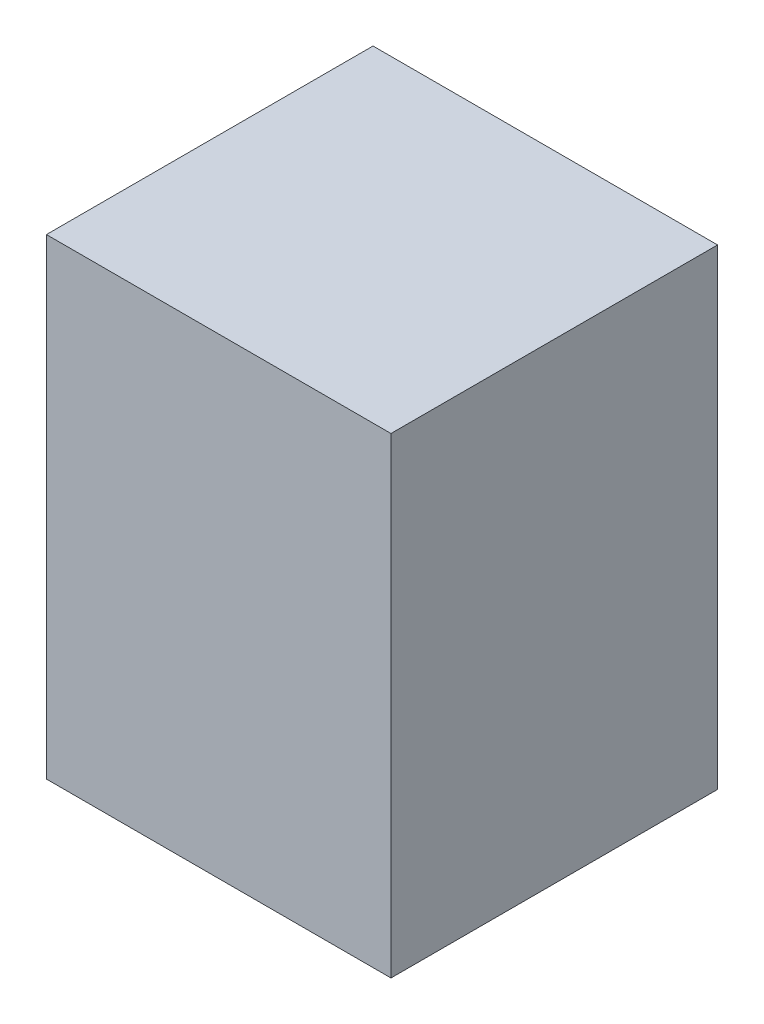
ISO-10303-21;
HEADER;
FILE_DESCRIPTION(('STEP AP214'),'2;1');
FILE_NAME('part.step','',(''),(''),'','','');
FILE_SCHEMA(('AUTOMOTIVE_DESIGN { 1 0 10303 214 1 1 1 1 }'));
ENDSEC;
DATA;
#1=APPLICATION_CONTEXT('core data for automotive mechanical design processes');
#2=APPLICATION_PROTOCOL_DEFINITION('international standard','automotive_design',2000,#1);
#3=PRODUCT_CONTEXT('',#1,'mechanical');
#4=PRODUCT('Part','Part','',(#3));
#5=PRODUCT_RELATED_PRODUCT_CATEGORY('part','',(#4));
#6=PRODUCT_DEFINITION_FORMATION('','',#4);
#7=PRODUCT_DEFINITION_CONTEXT('part definition',#1,'design');
#8=PRODUCT_DEFINITION('design','',#6,#7);
#9=PRODUCT_DEFINITION_SHAPE('','',#8);
#10=(LENGTH_UNIT() NAMED_UNIT(*) SI_UNIT(.MILLI.,.METRE.));
#11=(NAMED_UNIT(*) PLANE_ANGLE_UNIT() SI_UNIT($,.RADIAN.));
#12=(NAMED_UNIT(*) SI_UNIT($,.STERADIAN.) SOLID_ANGLE_UNIT());
#13=UNCERTAINTY_MEASURE_WITH_UNIT(LENGTH_MEASURE(1.E-05),#10,'distance_accuracy_value','');
#14=(GEOMETRIC_REPRESENTATION_CONTEXT(3) GLOBAL_UNCERTAINTY_ASSIGNED_CONTEXT((#13)) GLOBAL_UNIT_ASSIGNED_CONTEXT((#10,
#11,#12)) REPRESENTATION_CONTEXT('',''));
#15=CARTESIAN_POINT('',(0.,0.,0.));
#16=DIRECTION('',(0.,0.,1.));
#17=DIRECTION('',(1.,0.,0.));
#18=AXIS2_PLACEMENT_3D('',#15,#16,#17);
#19=CARTESIAN_POINT('',(0.,0.,1.79999894));
#20=DIRECTION('',(0.,0.,-1.));
#21=DIRECTION('',(-1.,0.,0.));
#22=AXIS2_PLACEMENT_3D('',#19,#20,#21);
#23=PLANE('',#22);
#24=DIRECTION('',(1.,0.,0.));
#25=VECTOR('',#24,1.);
#26=CARTESIAN_POINT('',(-0.94949264,1.29949194,1.79999894));
#27=LINE('',#26,#25);
#28=CARTESIAN_POINT('',(-0.94949264,1.29949194,1.79999894));
#29=VERTEX_POINT('',#28);
#30=CARTESIAN_POINT('',(0.94949264,1.29949194,1.79999894));
#31=VERTEX_POINT('',#30);
#32=EDGE_CURVE('E68',#29,#31,#27,.T.);
#33=ORIENTED_EDGE('',*,*,#32,.F.);
#34=DIRECTION('',(0.,1.,0.));
#35=VECTOR('',#34,1.);
#36=CARTESIAN_POINT('',(-0.94949264,-1.29949194,1.79999894));
#37=LINE('',#36,#35);
#38=CARTESIAN_POINT('',(-0.94949264,-1.29949194,1.79999894));
#39=VERTEX_POINT('',#38);
#40=EDGE_CURVE('E55',#39,#29,#37,.T.);
#41=ORIENTED_EDGE('',*,*,#40,.F.);
#42=DIRECTION('',(1.,0.,0.));
#43=VECTOR('',#42,1.);
#44=CARTESIAN_POINT('',(0.94949264,-1.29949194,1.79999894));
#45=LINE('',#44,#43);
#46=CARTESIAN_POINT('',(0.94949264,-1.29949194,1.79999894));
#47=VERTEX_POINT('',#46);
#48=EDGE_CURVE('E20',#47,#39,#45,.F.);
#49=ORIENTED_EDGE('',*,*,#48,.F.);
#50=DIRECTION('',(0.,1.,0.));
#51=VECTOR('',#50,1.);
#52=CARTESIAN_POINT('',(0.94949264,1.29949194,1.79999894));
#53=LINE('',#52,#51);
#54=EDGE_CURVE('E80',#31,#47,#53,.F.);
#55=ORIENTED_EDGE('',*,*,#54,.F.);
#56=EDGE_LOOP('',(#33,#41,#49,#55));
#57=FACE_BOUND('',#56,.T.);
#58=ADVANCED_FACE('F17',(#57),#23,.F.);
#59=CARTESIAN_POINT('',(0.94949264,-1.29949194,0.));
#60=DIRECTION('',(0.,-1.,0.));
#61=DIRECTION('',(0.,0.,-1.));
#62=AXIS2_PLACEMENT_3D('',#59,#60,#61);
#63=PLANE('',#62);
#64=DIRECTION('',(0.,0.,1.));
#65=VECTOR('',#64,1.);
#66=CARTESIAN_POINT('',(-0.94949264,-1.29949194,0.));
#67=LINE('',#66,#65);
#68=CARTESIAN_POINT('',(-0.94949264,-1.29949194,0.));
#69=VERTEX_POINT('',#68);
#70=EDGE_CURVE('E61',#69,#39,#67,.T.);
#71=ORIENTED_EDGE('',*,*,#70,.F.);
#72=DIRECTION('',(-1.,0.,0.));
#73=VECTOR('',#72,1.);
#74=CARTESIAN_POINT('',(0.,-1.29949194,0.));
#75=LINE('',#74,#73);
#76=CARTESIAN_POINT('',(0.94949264,-1.29949194,0.));
#77=VERTEX_POINT('',#76);
#78=EDGE_CURVE('E83',#77,#69,#75,.T.);
#79=ORIENTED_EDGE('',*,*,#78,.F.);
#80=DIRECTION('',(0.,0.,-1.));
#81=VECTOR('',#80,1.);
#82=CARTESIAN_POINT('',(0.94949264,-1.29949194,0.));
#83=LINE('',#82,#81);
#84=EDGE_CURVE('E64',#47,#77,#83,.T.);
#85=ORIENTED_EDGE('',*,*,#84,.F.);
#86=ORIENTED_EDGE('',*,*,#48,.T.);
#87=EDGE_LOOP('',(#71,#79,#85,#86));
#88=FACE_BOUND('',#87,.T.);
#89=ADVANCED_FACE('F60',(#88),#63,.T.);
#90=CARTESIAN_POINT('',(-0.94949264,-1.29949194,0.));
#91=DIRECTION('',(-1.,0.,0.));
#92=DIRECTION('',(0.,0.,1.));
#93=AXIS2_PLACEMENT_3D('',#90,#91,#92);
#94=PLANE('',#93);
#95=DIRECTION('',(0.,0.,1.));
#96=VECTOR('',#95,1.);
#97=CARTESIAN_POINT('',(-0.94949264,1.29949194,0.));
#98=LINE('',#97,#96);
#99=CARTESIAN_POINT('',(-0.94949264,1.29949194,0.));
#100=VERTEX_POINT('',#99);
#101=EDGE_CURVE('E70',#100,#29,#98,.T.);
#102=ORIENTED_EDGE('',*,*,#101,.F.);
#103=DIRECTION('',(0.,1.,0.));
#104=VECTOR('',#103,1.);
#105=CARTESIAN_POINT('',(-0.94949264,0.,0.));
#106=LINE('',#105,#104);
#107=EDGE_CURVE('E74',#69,#100,#106,.T.);
#108=ORIENTED_EDGE('',*,*,#107,.F.);
#109=ORIENTED_EDGE('',*,*,#70,.T.);
#110=ORIENTED_EDGE('',*,*,#40,.T.);
#111=EDGE_LOOP('',(#102,#108,#109,#110));
#112=FACE_BOUND('',#111,.T.);
#113=ADVANCED_FACE('F72',(#112),#94,.T.);
#114=CARTESIAN_POINT('',(-0.94949264,1.29949194,0.));
#115=DIRECTION('',(0.,1.,0.));
#116=DIRECTION('',(0.,0.,1.));
#117=AXIS2_PLACEMENT_3D('',#114,#115,#116);
#118=PLANE('',#117);
#119=DIRECTION('',(0.,0.,-1.));
#120=VECTOR('',#119,1.);
#121=CARTESIAN_POINT('',(0.94949264,1.29949194,0.));
#122=LINE('',#121,#120);
#123=CARTESIAN_POINT('',(0.94949264,1.29949194,0.));
#124=VERTEX_POINT('',#123);
#125=EDGE_CURVE('E35',#124,#31,#122,.F.);
#126=ORIENTED_EDGE('',*,*,#125,.F.);
#127=DIRECTION('',(-1.,0.,0.));
#128=VECTOR('',#127,1.);
#129=CARTESIAN_POINT('',(0.,1.29949194,0.));
#130=LINE('',#129,#128);
#131=EDGE_CURVE('E26',#100,#124,#130,.F.);
#132=ORIENTED_EDGE('',*,*,#131,.F.);
#133=ORIENTED_EDGE('',*,*,#101,.T.);
#134=ORIENTED_EDGE('',*,*,#32,.T.);
#135=EDGE_LOOP('',(#126,#132,#133,#134));
#136=FACE_BOUND('',#135,.T.);
#137=ADVANCED_FACE('F89',(#136),#118,.T.);
#138=CARTESIAN_POINT('',(0.94949264,1.29949194,0.));
#139=DIRECTION('',(1.,0.,0.));
#140=DIRECTION('',(0.,0.,-1.));
#141=AXIS2_PLACEMENT_3D('',#138,#139,#140);
#142=PLANE('',#141);
#143=ORIENTED_EDGE('',*,*,#84,.T.);
#144=DIRECTION('',(0.,1.,0.));
#145=VECTOR('',#144,1.);
#146=CARTESIAN_POINT('',(0.94949264,0.,0.));
#147=LINE('',#146,#145);
#148=EDGE_CURVE('E11',#124,#77,#147,.F.);
#149=ORIENTED_EDGE('',*,*,#148,.F.);
#150=ORIENTED_EDGE('',*,*,#125,.T.);
#151=ORIENTED_EDGE('',*,*,#54,.T.);
#152=EDGE_LOOP('',(#143,#149,#150,#151));
#153=FACE_BOUND('',#152,.T.);
#154=ADVANCED_FACE('F91',(#153),#142,.T.);
#155=CARTESIAN_POINT('',(0.,0.,0.));
#156=DIRECTION('',(0.,0.,-1.));
#157=DIRECTION('',(-1.,0.,0.));
#158=AXIS2_PLACEMENT_3D('',#155,#156,#157);
#159=PLANE('',#158);
#160=ORIENTED_EDGE('',*,*,#131,.T.);
#161=ORIENTED_EDGE('',*,*,#148,.T.);
#162=ORIENTED_EDGE('',*,*,#78,.T.);
#163=ORIENTED_EDGE('',*,*,#107,.T.);
#164=EDGE_LOOP('',(#160,#161,#162,#163));
#165=FACE_BOUND('',#164,.T.);
#166=ADVANCED_FACE('F88',(#165),#159,.T.);
#167=CLOSED_SHELL('',(#58,#89,#113,#137,#154,#166));
#168=MANIFOLD_SOLID_BREP('B1',#167);
#169=ADVANCED_BREP_SHAPE_REPRESENTATION('',(#18,#168),#14);
#170=SHAPE_DEFINITION_REPRESENTATION(#9,#169);
ENDSEC;
END-ISO-10303-21;
